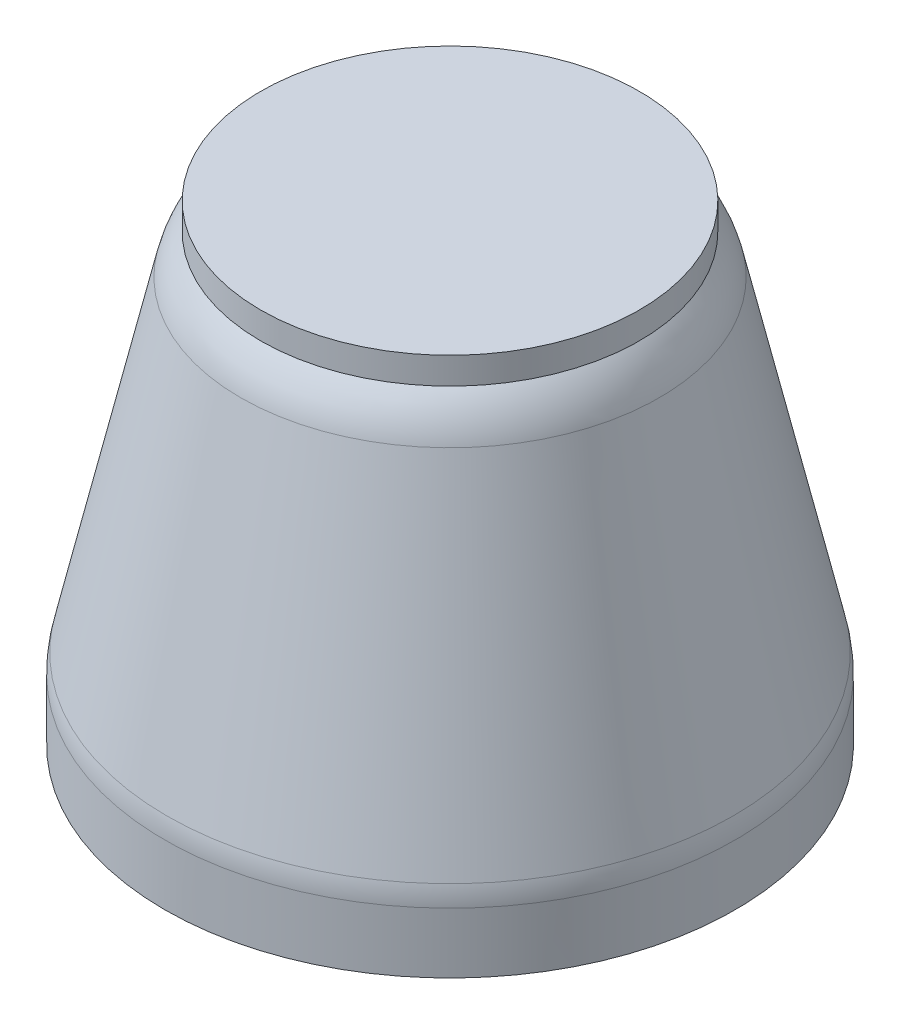
ISO-10303-21;
HEADER;
FILE_DESCRIPTION(('STEP AP214'),'2;1');
FILE_NAME('part.step','',(''),(''),'','','');
FILE_SCHEMA(('AUTOMOTIVE_DESIGN { 1 0 10303 214 1 1 1 1 }'));
ENDSEC;
DATA;
#1=APPLICATION_CONTEXT('core data for automotive mechanical design processes');
#2=APPLICATION_PROTOCOL_DEFINITION('international standard','automotive_design',2000,#1);
#3=PRODUCT_CONTEXT('',#1,'mechanical');
#4=PRODUCT('Part','Part','',(#3));
#5=PRODUCT_RELATED_PRODUCT_CATEGORY('part','',(#4));
#6=PRODUCT_DEFINITION_FORMATION('','',#4);
#7=PRODUCT_DEFINITION_CONTEXT('part definition',#1,'design');
#8=PRODUCT_DEFINITION('design','',#6,#7);
#9=PRODUCT_DEFINITION_SHAPE('','',#8);
#10=(LENGTH_UNIT() NAMED_UNIT(*) SI_UNIT(.MILLI.,.METRE.));
#11=(NAMED_UNIT(*) PLANE_ANGLE_UNIT() SI_UNIT($,.RADIAN.));
#12=(NAMED_UNIT(*) SI_UNIT($,.STERADIAN.) SOLID_ANGLE_UNIT());
#13=UNCERTAINTY_MEASURE_WITH_UNIT(LENGTH_MEASURE(1.E-05),#10,'distance_accuracy_value','');
#14=(GEOMETRIC_REPRESENTATION_CONTEXT(3) GLOBAL_UNCERTAINTY_ASSIGNED_CONTEXT((#13)) GLOBAL_UNIT_ASSIGNED_CONTEXT((#10,
#11,#12)) REPRESENTATION_CONTEXT('',''));
#15=CARTESIAN_POINT('',(0.,0.,0.));
#16=DIRECTION('',(0.,0.,1.));
#17=DIRECTION('',(1.,0.,0.));
#18=AXIS2_PLACEMENT_3D('',#15,#16,#17);
#19=CARTESIAN_POINT('',(0.,15.8,0.));
#20=DIRECTION('',(0.,-1.,0.));
#21=DIRECTION('',(0.,0.,-1.));
#22=AXIS2_PLACEMENT_3D('',#19,#20,#21);
#23=CYLINDRICAL_SURFACE('',#22,64.);
#24=CARTESIAN_POINT('',(0.,13.5663089692838,0.));
#25=DIRECTION('',(0.,-1.,0.));
#26=DIRECTION('',(0.,0.,-1.));
#27=AXIS2_PLACEMENT_3D('',#24,#25,#26);
#28=CIRCLE('',#27,64.);
#29=CARTESIAN_POINT('',(0.,13.5663089692838,-64.));
#30=VERTEX_POINT('',#29);
#31=EDGE_CURVE('E11',#30,#30,#28,.T.);
#32=ORIENTED_EDGE('',*,*,#31,.T.);
#33=EDGE_LOOP('',(#32));
#34=FACE_BOUND('',#33,.T.);
#35=CARTESIAN_POINT('',(0.,0.,0.));
#36=DIRECTION('',(0.,1.,0.));
#37=DIRECTION('',(0.,0.,1.));
#38=AXIS2_PLACEMENT_3D('',#35,#36,#37);
#39=CIRCLE('',#38,64.);
#40=CARTESIAN_POINT('',(0.,0.,64.));
#41=VERTEX_POINT('',#40);
#42=EDGE_CURVE('E54',#41,#41,#39,.T.);
#43=ORIENTED_EDGE('',*,*,#42,.T.);
#44=EDGE_LOOP('',(#43));
#45=FACE_BOUND('',#44,.T.);
#46=ADVANCED_FACE('F39',(#34,#45),#23,.T.);
#47=CARTESIAN_POINT('',(0.,0.,0.));
#48=DIRECTION('',(0.,1.,0.));
#49=DIRECTION('',(0.,0.,1.));
#50=AXIS2_PLACEMENT_3D('',#47,#48,#49);
#51=PLANE('',#50);
#52=CARTESIAN_POINT('',(0.,0.,0.));
#53=DIRECTION('',(0.,-1.,0.));
#54=DIRECTION('',(0.,0.,-1.));
#55=AXIS2_PLACEMENT_3D('',#52,#53,#54);
#56=CIRCLE('',#55,50.);
#57=CARTESIAN_POINT('',(0.,0.,-50.));
#58=VERTEX_POINT('',#57);
#59=EDGE_CURVE('E68',#58,#58,#56,.T.);
#60=ORIENTED_EDGE('',*,*,#59,.F.);
#61=EDGE_LOOP('',(#60));
#62=FACE_BOUND('',#61,.T.);
#63=ORIENTED_EDGE('',*,*,#42,.F.);
#64=EDGE_LOOP('',(#63));
#65=FACE_BOUND('',#64,.T.);
#66=ADVANCED_FACE('F74',(#62,#65),#51,.F.);
#67=CARTESIAN_POINT('',(0.,99.8,0.));
#68=DIRECTION('',(0.,-1.,0.));
#69=DIRECTION('',(0.,0.,-1.));
#70=AXIS2_PLACEMENT_3D('',#67,#68,#69);
#71=CONICAL_SURFACE('',#70,45.,0.222447265425942);
#72=CARTESIAN_POINT('',(0.,91.0034813089583,0.));
#73=DIRECTION('',(0.,-1.,0.));
#74=DIRECTION('',(0.,0.,-1.));
#75=AXIS2_PLACEMENT_3D('',#72,#73,#74);
#76=CIRCLE('',#75,46.9896887515452);
#77=CARTESIAN_POINT('',(0.,91.0034813089583,-46.9896887515452));
#78=VERTEX_POINT('',#77);
#79=EDGE_CURVE('E46',#78,#78,#76,.T.);
#80=ORIENTED_EDGE('',*,*,#79,.T.);
#81=EDGE_LOOP('',(#80));
#82=FACE_BOUND('',#81,.T.);
#83=CARTESIAN_POINT('',(0.,17.9786539149611,0.));
#84=DIRECTION('',(0.,-1.,0.));
#85=DIRECTION('',(0.,0.,-1.));
#86=AXIS2_PLACEMENT_3D('',#83,#84,#85);
#87=CIRCLE('',#86,63.5072092335207);
#88=CARTESIAN_POINT('',(0.,17.9786539149611,-63.5072092335207));
#89=VERTEX_POINT('',#88);
#90=EDGE_CURVE('E50',#89,#89,#87,.F.);
#91=ORIENTED_EDGE('',*,*,#90,.T.);
#92=EDGE_LOOP('',(#91));
#93=FACE_BOUND('',#92,.T.);
#94=ADVANCED_FACE('F77',(#82,#93),#71,.T.);
#95=CARTESIAN_POINT('',(0.,105.8,0.));
#96=DIRECTION('',(0.,-1.,0.));
#97=DIRECTION('',(0.,0.,-1.));
#98=AXIS2_PLACEMENT_3D('',#95,#96,#97);
#99=CYLINDRICAL_SURFACE('',#98,42.5);
#100=CARTESIAN_POINT('',(0.,105.8,0.));
#101=DIRECTION('',(0.,1.,0.));
#102=DIRECTION('',(0.,0.,1.));
#103=AXIS2_PLACEMENT_3D('',#100,#101,#102);
#104=CIRCLE('',#103,42.5);
#105=CARTESIAN_POINT('',(0.,105.8,42.5));
#106=VERTEX_POINT('',#105);
#107=EDGE_CURVE('E59',#106,#106,#104,.T.);
#108=ORIENTED_EDGE('',*,*,#107,.F.);
#109=EDGE_LOOP('',(#108));
#110=FACE_BOUND('',#109,.T.);
#111=CARTESIAN_POINT('',(0.,99.8,0.));
#112=DIRECTION('',(0.,1.,0.));
#113=DIRECTION('',(0.,0.,1.));
#114=AXIS2_PLACEMENT_3D('',#111,#112,#113);
#115=CIRCLE('',#114,42.5);
#116=CARTESIAN_POINT('',(0.,99.8,42.5));
#117=VERTEX_POINT('',#116);
#118=EDGE_CURVE('E60',#117,#117,#115,.T.);
#119=ORIENTED_EDGE('',*,*,#118,.T.);
#120=EDGE_LOOP('',(#119));
#121=FACE_BOUND('',#120,.T.);
#122=ADVANCED_FACE('F95',(#110,#121),#99,.T.);
#123=CARTESIAN_POINT('',(0.,105.8,0.));
#124=DIRECTION('',(0.,1.,0.));
#125=DIRECTION('',(0.,0.,1.));
#126=AXIS2_PLACEMENT_3D('',#123,#124,#125);
#127=PLANE('',#126);
#128=ORIENTED_EDGE('',*,*,#107,.T.);
#129=EDGE_LOOP('',(#128));
#130=FACE_BOUND('',#129,.T.);
#131=ADVANCED_FACE('F88',(#130),#127,.T.);
#132=CARTESIAN_POINT('',(0.,86.591136363281,0.));
#133=DIRECTION('',(0.,1.,0.));
#134=DIRECTION('',(0.,0.,1.));
#135=AXIS2_PLACEMENT_3D('',#132,#133,#134);
#136=TOROIDAL_SURFACE('',#135,27.4824795180244,20.);
#137=ORIENTED_EDGE('',*,*,#79,.F.);
#138=EDGE_LOOP('',(#137));
#139=FACE_BOUND('',#138,.T.);
#140=ORIENTED_EDGE('',*,*,#118,.F.);
#141=EDGE_LOOP('',(#140));
#142=FACE_BOUND('',#141,.T.);
#143=ADVANCED_FACE('F86',(#139,#142),#136,.T.);
#144=CARTESIAN_POINT('',(0.,13.5663089692838,0.));
#145=DIRECTION('',(0.,-1.,0.));
#146=DIRECTION('',(0.,0.,-1.));
#147=AXIS2_PLACEMENT_3D('',#144,#145,#146);
#148=TOROIDAL_SURFACE('',#147,44.,20.);
#149=ORIENTED_EDGE('',*,*,#31,.F.);
#150=EDGE_LOOP('',(#149));
#151=FACE_BOUND('',#150,.T.);
#152=ORIENTED_EDGE('',*,*,#90,.F.);
#153=EDGE_LOOP('',(#152));
#154=FACE_BOUND('',#153,.T.);
#155=ADVANCED_FACE('F41',(#151,#154),#148,.T.);
#156=CARTESIAN_POINT('',(0.,0.,0.));
#157=DIRECTION('',(0.,-1.,0.));
#158=DIRECTION('',(0.,0.,-1.));
#159=AXIS2_PLACEMENT_3D('',#156,#157,#158);
#160=CONICAL_SURFACE('',#159,50.,0.349065850398867);
#161=CARTESIAN_POINT('',(0.,6.,0.));
#162=DIRECTION('',(0.,-1.,0.));
#163=DIRECTION('',(0.,0.,-1.));
#164=AXIS2_PLACEMENT_3D('',#161,#162,#163);
#165=CIRCLE('',#164,47.8161785944028);
#166=CARTESIAN_POINT('',(0.,6.,-47.8161785944028));
#167=VERTEX_POINT('',#166);
#168=EDGE_CURVE('E63',#167,#167,#165,.T.);
#169=ORIENTED_EDGE('',*,*,#168,.F.);
#170=EDGE_LOOP('',(#169));
#171=FACE_BOUND('',#170,.T.);
#172=ORIENTED_EDGE('',*,*,#59,.T.);
#173=EDGE_LOOP('',(#172));
#174=FACE_BOUND('',#173,.T.);
#175=ADVANCED_FACE('F72',(#171,#174),#160,.F.);
#176=CARTESIAN_POINT('',(0.,6.,0.));
#177=DIRECTION('',(0.,-1.,0.));
#178=DIRECTION('',(0.,0.,-1.));
#179=AXIS2_PLACEMENT_3D('',#176,#177,#178);
#180=PLANE('',#179);
#181=ORIENTED_EDGE('',*,*,#168,.T.);
#182=EDGE_LOOP('',(#181));
#183=FACE_BOUND('',#182,.T.);
#184=ADVANCED_FACE('F111',(#183),#180,.T.);
#185=CLOSED_SHELL('',(#46,#66,#94,#122,#131,#143,#155,#175,#184));
#186=MANIFOLD_SOLID_BREP('B2',#185);
#187=ADVANCED_BREP_SHAPE_REPRESENTATION('',(#18,#186),#14);
#188=SHAPE_DEFINITION_REPRESENTATION(#9,#187);
ENDSEC;
END-ISO-10303-21;
